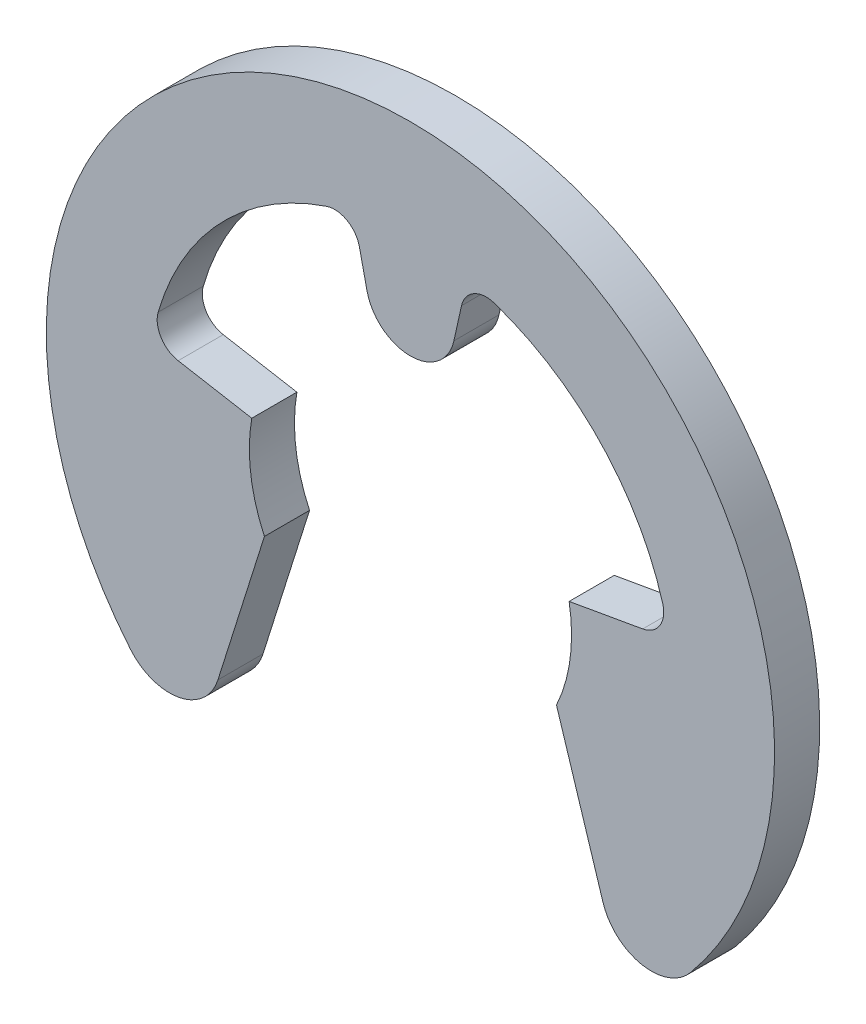
ISO-10303-21;
HEADER;
FILE_DESCRIPTION(('STEP AP214'),'2;1');
FILE_NAME('part.step','',(''),(''),'','','');
FILE_SCHEMA(('AUTOMOTIVE_DESIGN { 1 0 10303 214 1 1 1 1 }'));
ENDSEC;
DATA;
#1=APPLICATION_CONTEXT('core data for automotive mechanical design processes');
#2=APPLICATION_PROTOCOL_DEFINITION('international standard','automotive_design',2000,#1);
#3=PRODUCT_CONTEXT('',#1,'mechanical');
#4=PRODUCT('Part','Part','',(#3));
#5=PRODUCT_RELATED_PRODUCT_CATEGORY('part','',(#4));
#6=PRODUCT_DEFINITION_FORMATION('','',#4);
#7=PRODUCT_DEFINITION_CONTEXT('part definition',#1,'design');
#8=PRODUCT_DEFINITION('design','',#6,#7);
#9=PRODUCT_DEFINITION_SHAPE('','',#8);
#10=(LENGTH_UNIT() NAMED_UNIT(*) SI_UNIT(.MILLI.,.METRE.));
#11=(NAMED_UNIT(*) PLANE_ANGLE_UNIT() SI_UNIT($,.RADIAN.));
#12=(NAMED_UNIT(*) SI_UNIT($,.STERADIAN.) SOLID_ANGLE_UNIT());
#13=UNCERTAINTY_MEASURE_WITH_UNIT(LENGTH_MEASURE(1.E-05),#10,'distance_accuracy_value','');
#14=(GEOMETRIC_REPRESENTATION_CONTEXT(3) GLOBAL_UNCERTAINTY_ASSIGNED_CONTEXT((#13)) GLOBAL_UNIT_ASSIGNED_CONTEXT((#10,
#11,#12)) REPRESENTATION_CONTEXT('',''));
#15=CARTESIAN_POINT('',(0.,0.,0.));
#16=DIRECTION('',(0.,0.,1.));
#17=DIRECTION('',(1.,0.,0.));
#18=AXIS2_PLACEMENT_3D('',#15,#16,#17);
#19=CARTESIAN_POINT('',(0.,0.,-0.7));
#20=DIRECTION('',(0.,0.,1.));
#21=DIRECTION('',(1.,0.,0.));
#22=AXIS2_PLACEMENT_3D('',#19,#20,#21);
#23=CYLINDRICAL_SURFACE('',#22,2.5);
#24=CARTESIAN_POINT('',(0.,0.,0.));
#25=DIRECTION('',(0.,0.,-1.));
#26=DIRECTION('',(1.,0.,0.));
#27=AXIS2_PLACEMENT_3D('',#24,#25,#26);
#28=CIRCLE('',#27,2.5);
#29=CARTESIAN_POINT('',(2.46201938253052,0.434120444167318,0.));
#30=VERTEX_POINT('',#29);
#31=CARTESIAN_POINT('',(2.26576946759162,-1.05654565435176,0.));
#32=VERTEX_POINT('',#31);
#33=EDGE_CURVE('E189',#30,#32,#28,.T.);
#34=ORIENTED_EDGE('',*,*,#33,.F.);
#35=DIRECTION('',(0.,0.,1.));
#36=VECTOR('',#35,1.);
#37=CARTESIAN_POINT('',(2.46201938253052,0.434120444167318,-0.7));
#38=LINE('',#37,#36);
#39=CARTESIAN_POINT('',(2.46201938253052,0.434120444167318,-0.7));
#40=VERTEX_POINT('',#39);
#41=EDGE_CURVE('E11',#40,#30,#38,.T.);
#42=ORIENTED_EDGE('',*,*,#41,.F.);
#43=CARTESIAN_POINT('',(0.,0.,-0.7));
#44=DIRECTION('',(0.,0.,-1.));
#45=DIRECTION('',(1.,0.,0.));
#46=AXIS2_PLACEMENT_3D('',#43,#44,#45);
#47=CIRCLE('',#46,2.5);
#48=CARTESIAN_POINT('',(2.26576946759162,-1.05654565435176,-0.7));
#49=VERTEX_POINT('',#48);
#50=EDGE_CURVE('E239',#40,#49,#47,.T.);
#51=ORIENTED_EDGE('',*,*,#50,.T.);
#52=DIRECTION('',(0.,0.,1.));
#53=VECTOR('',#52,1.);
#54=CARTESIAN_POINT('',(2.26576946759162,-1.05654565435176,-0.7));
#55=LINE('',#54,#53);
#56=EDGE_CURVE('E35',#49,#32,#55,.T.);
#57=ORIENTED_EDGE('',*,*,#56,.T.);
#58=EDGE_LOOP('',(#34,#42,#51,#57));
#59=FACE_BOUND('',#58,.T.);
#60=ADVANCED_FACE('F32',(#59),#23,.F.);
#61=CARTESIAN_POINT('',(2.46201938253052,0.434120444167318,-0.7));
#62=DIRECTION('',(-0.173648177666928,0.984807753012209,0.));
#63=DIRECTION('',(-0.984807753012209,-0.173648177666928,0.));
#64=AXIS2_PLACEMENT_3D('',#61,#62,#63);
#65=PLANE('',#64);
#66=DIRECTION('',(-0.984807753012208,-0.173648177666928,0.));
#67=VECTOR('',#66,1.);
#68=CARTESIAN_POINT('',(2.46201938253052,0.434120444167318,0.));
#69=LINE('',#68,#67);
#70=CARTESIAN_POINT('',(3.60452586515531,0.635575162688392,0.));
#71=VERTEX_POINT('',#70);
#72=EDGE_CURVE('E237',#71,#30,#69,.T.);
#73=ORIENTED_EDGE('',*,*,#72,.F.);
#74=DIRECTION('',(0.,0.,1.));
#75=VECTOR('',#74,1.);
#76=CARTESIAN_POINT('',(3.60452586515531,0.635575162688392,-0.7));
#77=LINE('',#76,#75);
#78=CARTESIAN_POINT('',(3.60452586515531,0.635575162688392,-0.7));
#79=VERTEX_POINT('',#78);
#80=EDGE_CURVE('E41',#79,#71,#77,.T.);
#81=ORIENTED_EDGE('',*,*,#80,.F.);
#82=DIRECTION('',(-0.984807753012208,-0.173648177666928,0.));
#83=VECTOR('',#82,1.);
#84=CARTESIAN_POINT('',(2.46201938253052,0.434120444167318,-0.7));
#85=LINE('',#84,#83);
#86=EDGE_CURVE('E179',#79,#40,#85,.T.);
#87=ORIENTED_EDGE('',*,*,#86,.T.);
#88=ORIENTED_EDGE('',*,*,#41,.T.);
#89=EDGE_LOOP('',(#73,#81,#87,#88));
#90=FACE_BOUND('',#89,.T.);
#91=ADVANCED_FACE('F271',(#90),#65,.T.);
#92=CARTESIAN_POINT('',(3.53615189519896,1.02334321543695,-0.7));
#93=DIRECTION('',(0.,0.,1.));
#94=DIRECTION('',(1.,0.,0.));
#95=AXIS2_PLACEMENT_3D('',#92,#93,#94);
#96=CYLINDRICAL_SURFACE('',#95,0.39375);
#97=CARTESIAN_POINT('',(3.53615189519896,1.02334321543695,0.));
#98=DIRECTION('',(0.,0.,-1.));
#99=DIRECTION('',(1.,0.,0.));
#100=AXIS2_PLACEMENT_3D('',#97,#98,#99);
#101=CIRCLE('',#100,0.39375);
#102=CARTESIAN_POINT('',(3.91438206395538,1.13280097871798,0.));
#103=VERTEX_POINT('',#102);
#104=EDGE_CURVE('E166',#103,#71,#101,.T.);
#105=ORIENTED_EDGE('',*,*,#104,.F.);
#106=DIRECTION('',(0.,0.,1.));
#107=VECTOR('',#106,1.);
#108=CARTESIAN_POINT('',(3.91438206395538,1.13280097871798,-0.7));
#109=LINE('',#108,#107);
#110=CARTESIAN_POINT('',(3.91438206395538,1.13280097871798,-0.7));
#111=VERTEX_POINT('',#110);
#112=EDGE_CURVE('E161',#111,#103,#109,.T.);
#113=ORIENTED_EDGE('',*,*,#112,.F.);
#114=CARTESIAN_POINT('',(3.53615189519896,1.02334321543695,-0.7));
#115=DIRECTION('',(0.,0.,-1.));
#116=DIRECTION('',(1.,0.,0.));
#117=AXIS2_PLACEMENT_3D('',#114,#115,#116);
#118=CIRCLE('',#117,0.39375);
#119=EDGE_CURVE('E164',#111,#79,#118,.T.);
#120=ORIENTED_EDGE('',*,*,#119,.T.);
#121=ORIENTED_EDGE('',*,*,#80,.T.);
#122=EDGE_LOOP('',(#105,#113,#120,#121));
#123=FACE_BOUND('',#122,.T.);
#124=ADVANCED_FACE('F163',(#123),#96,.F.);
#125=CARTESIAN_POINT('',(0.,0.,-0.7));
#126=DIRECTION('',(0.,0.,1.));
#127=DIRECTION('',(1.,0.,0.));
#128=AXIS2_PLACEMENT_3D('',#125,#126,#127);
#129=CYLINDRICAL_SURFACE('',#128,4.075);
#130=CARTESIAN_POINT('',(0.,0.,0.));
#131=DIRECTION('',(0.,0.,-1.));
#132=DIRECTION('',(1.,0.,0.));
#133=AXIS2_PLACEMENT_3D('',#130,#131,#132);
#134=CIRCLE('',#133,4.075);
#135=CARTESIAN_POINT('',(1.30246575073799,3.86124435488801,0.));
#136=VERTEX_POINT('',#135);
#137=EDGE_CURVE('E234',#136,#103,#134,.T.);
#138=ORIENTED_EDGE('',*,*,#137,.F.);
#139=DIRECTION('',(0.,0.,1.));
#140=VECTOR('',#139,1.);
#141=CARTESIAN_POINT('',(1.30246575073799,3.86124435488801,-0.7));
#142=LINE('',#141,#140);
#143=CARTESIAN_POINT('',(1.30246575073799,3.86124435488801,-0.7));
#144=VERTEX_POINT('',#143);
#145=EDGE_CURVE('E171',#144,#136,#142,.T.);
#146=ORIENTED_EDGE('',*,*,#145,.F.);
#147=CARTESIAN_POINT('',(0.,0.,-0.7));
#148=DIRECTION('',(0.,0.,-1.));
#149=DIRECTION('',(1.,0.,0.));
#150=AXIS2_PLACEMENT_3D('',#147,#148,#149);
#151=CIRCLE('',#150,4.075);
#152=EDGE_CURVE('E177',#144,#111,#151,.T.);
#153=ORIENTED_EDGE('',*,*,#152,.T.);
#154=ORIENTED_EDGE('',*,*,#112,.T.);
#155=EDGE_LOOP('',(#138,#146,#153,#154));
#156=FACE_BOUND('',#155,.T.);
#157=ADVANCED_FACE('F181',(#156),#129,.F.);
#158=CARTESIAN_POINT('',(1.17661399874951,3.48814865802,-0.7));
#159=DIRECTION('',(0.,0.,1.));
#160=DIRECTION('',(1.,0.,0.));
#161=AXIS2_PLACEMENT_3D('',#158,#159,#160);
#162=CYLINDRICAL_SURFACE('',#161,0.39375);
#163=CARTESIAN_POINT('',(1.17661399874951,3.48814865802,0.));
#164=DIRECTION('',(0.,0.,-1.));
#165=DIRECTION('',(1.,0.,0.));
#166=AXIS2_PLACEMENT_3D('',#163,#164,#165);
#167=CIRCLE('',#166,0.39375);
#168=CARTESIAN_POINT('',(0.792197445946035,3.57337175600812,0.));
#169=VERTEX_POINT('',#168);
#170=EDGE_CURVE('E231',#169,#136,#167,.T.);
#171=ORIENTED_EDGE('',*,*,#170,.F.);
#172=DIRECTION('',(0.,0.,1.));
#173=VECTOR('',#172,1.);
#174=CARTESIAN_POINT('',(0.792197445946035,3.57337175600812,-0.7));
#175=LINE('',#174,#173);
#176=CARTESIAN_POINT('',(0.792197445946035,3.57337175600812,-0.7));
#177=VERTEX_POINT('',#176);
#178=EDGE_CURVE('E243',#177,#169,#175,.T.);
#179=ORIENTED_EDGE('',*,*,#178,.F.);
#180=CARTESIAN_POINT('',(1.17661399874951,3.48814865802,-0.7));
#181=DIRECTION('',(0.,0.,-1.));
#182=DIRECTION('',(1.,0.,0.));
#183=AXIS2_PLACEMENT_3D('',#180,#181,#182);
#184=CIRCLE('',#183,0.39375);
#185=EDGE_CURVE('E182',#177,#144,#184,.T.);
#186=ORIENTED_EDGE('',*,*,#185,.T.);
#187=ORIENTED_EDGE('',*,*,#145,.T.);
#188=EDGE_LOOP('',(#171,#179,#186,#187));
#189=FACE_BOUND('',#188,.T.);
#190=ADVANCED_FACE('F284',(#189),#162,.F.);
#191=CARTESIAN_POINT('',(0.674195424593791,3.04109903484525,-0.7));
#192=DIRECTION('',(0.976296007119933,-0.216439613938103,0.));
#193=DIRECTION('',(0.216439613938103,0.976296007119933,0.));
#194=AXIS2_PLACEMENT_3D('',#191,#192,#193);
#195=PLANE('',#194);
#196=DIRECTION('',(0.216439613938103,0.976296007119933,0.));
#197=VECTOR('',#196,1.);
#198=CARTESIAN_POINT('',(0.674195424593791,3.04109903484525,0.));
#199=LINE('',#198,#197);
#200=CARTESIAN_POINT('',(0.674195424593791,3.04109903484525,0.));
#201=VERTEX_POINT('',#200);
#202=EDGE_CURVE('E228',#201,#169,#199,.T.);
#203=ORIENTED_EDGE('',*,*,#202,.F.);
#204=DIRECTION('',(0.,0.,1.));
#205=VECTOR('',#204,1.);
#206=CARTESIAN_POINT('',(0.674195424593791,3.04109903484525,-0.7));
#207=LINE('',#206,#205);
#208=CARTESIAN_POINT('',(0.674195424593791,3.04109903484525,-0.7));
#209=VERTEX_POINT('',#208);
#210=EDGE_CURVE('E245',#209,#201,#207,.T.);
#211=ORIENTED_EDGE('',*,*,#210,.F.);
#212=DIRECTION('',(0.216439613938103,0.976296007119933,0.));
#213=VECTOR('',#212,1.);
#214=CARTESIAN_POINT('',(0.674195424593791,3.04109903484525,-0.7));
#215=LINE('',#214,#213);
#216=EDGE_CURVE('E184',#209,#177,#215,.T.);
#217=ORIENTED_EDGE('',*,*,#216,.T.);
#218=ORIENTED_EDGE('',*,*,#178,.T.);
#219=EDGE_LOOP('',(#203,#211,#217,#218));
#220=FACE_BOUND('',#219,.T.);
#221=ADVANCED_FACE('F287',(#220),#195,.T.);
#222=CARTESIAN_POINT('',(0.,3.19056456205598,-0.7));
#223=DIRECTION('',(0.,0.,1.));
#224=DIRECTION('',(1.,0.,0.));
#225=AXIS2_PLACEMENT_3D('',#222,#223,#224);
#226=CYLINDRICAL_SURFACE('',#225,0.690564562055992);
#227=CARTESIAN_POINT('',(0.,3.19056456205598,0.));
#228=DIRECTION('',(0.,0.,1.));
#229=DIRECTION('',(1.,0.,0.));
#230=AXIS2_PLACEMENT_3D('',#227,#228,#229);
#231=CIRCLE('',#230,0.690564562055992);
#232=CARTESIAN_POINT('',(-0.674195424593791,3.04109903484525,0.));
#233=VERTEX_POINT('',#232);
#234=EDGE_CURVE('E225',#233,#201,#231,.T.);
#235=ORIENTED_EDGE('',*,*,#234,.F.);
#236=DIRECTION('',(0.,0.,1.));
#237=VECTOR('',#236,1.);
#238=CARTESIAN_POINT('',(-0.674195424593791,3.04109903484525,-0.7));
#239=LINE('',#238,#237);
#240=CARTESIAN_POINT('',(-0.674195424593791,3.04109903484525,-0.7));
#241=VERTEX_POINT('',#240);
#242=EDGE_CURVE('E247',#241,#233,#239,.T.);
#243=ORIENTED_EDGE('',*,*,#242,.F.);
#244=CARTESIAN_POINT('',(0.,3.19056456205598,-0.7));
#245=DIRECTION('',(0.,0.,1.));
#246=DIRECTION('',(1.,0.,0.));
#247=AXIS2_PLACEMENT_3D('',#244,#245,#246);
#248=CIRCLE('',#247,0.690564562055992);
#249=EDGE_CURVE('E495',#241,#209,#248,.T.);
#250=ORIENTED_EDGE('',*,*,#249,.T.);
#251=ORIENTED_EDGE('',*,*,#210,.T.);
#252=EDGE_LOOP('',(#235,#243,#250,#251));
#253=FACE_BOUND('',#252,.T.);
#254=ADVANCED_FACE('F291',(#253),#226,.T.);
#255=CARTESIAN_POINT('',(-0.674195424593791,3.04109903484525,-0.7));
#256=DIRECTION('',(-0.976296007119933,-0.216439613938103,0.));
#257=DIRECTION('',(0.216439613938103,-0.976296007119933,0.));
#258=AXIS2_PLACEMENT_3D('',#255,#256,#257);
#259=PLANE('',#258);
#260=DIRECTION('',(0.216439613938103,-0.976296007119933,0.));
#261=VECTOR('',#260,1.);
#262=CARTESIAN_POINT('',(-0.674195424593791,3.04109903484525,0.));
#263=LINE('',#262,#261);
#264=CARTESIAN_POINT('',(-0.792197445946034,3.57337175600812,0.));
#265=VERTEX_POINT('',#264);
#266=EDGE_CURVE('E222',#265,#233,#263,.T.);
#267=ORIENTED_EDGE('',*,*,#266,.F.);
#268=DIRECTION('',(0.,0.,1.));
#269=VECTOR('',#268,1.);
#270=CARTESIAN_POINT('',(-0.792197445946034,3.57337175600812,-0.7));
#271=LINE('',#270,#269);
#272=CARTESIAN_POINT('',(-0.792197445946034,3.57337175600812,-0.7));
#273=VERTEX_POINT('',#272);
#274=EDGE_CURVE('E249',#273,#265,#271,.T.);
#275=ORIENTED_EDGE('',*,*,#274,.F.);
#276=DIRECTION('',(0.216439613938103,-0.976296007119933,0.));
#277=VECTOR('',#276,1.);
#278=CARTESIAN_POINT('',(-0.674195424593791,3.04109903484525,-0.7));
#279=LINE('',#278,#277);
#280=EDGE_CURVE('E499',#273,#241,#279,.T.);
#281=ORIENTED_EDGE('',*,*,#280,.T.);
#282=ORIENTED_EDGE('',*,*,#242,.T.);
#283=EDGE_LOOP('',(#267,#275,#281,#282));
#284=FACE_BOUND('',#283,.T.);
#285=ADVANCED_FACE('F295',(#284),#259,.T.);
#286=CARTESIAN_POINT('',(-1.17661399874951,3.48814865802,-0.7));
#287=DIRECTION('',(0.,0.,1.));
#288=DIRECTION('',(1.,0.,0.));
#289=AXIS2_PLACEMENT_3D('',#286,#287,#288);
#290=CYLINDRICAL_SURFACE('',#289,0.39375);
#291=CARTESIAN_POINT('',(-1.17661399874951,3.48814865802,0.));
#292=DIRECTION('',(0.,0.,-1.));
#293=DIRECTION('',(1.,0.,0.));
#294=AXIS2_PLACEMENT_3D('',#291,#292,#293);
#295=CIRCLE('',#294,0.39375);
#296=CARTESIAN_POINT('',(-1.302465750738,3.86124435488801,0.));
#297=VERTEX_POINT('',#296);
#298=EDGE_CURVE('E219',#297,#265,#295,.T.);
#299=ORIENTED_EDGE('',*,*,#298,.F.);
#300=DIRECTION('',(0.,0.,1.));
#301=VECTOR('',#300,1.);
#302=CARTESIAN_POINT('',(-1.302465750738,3.86124435488801,-0.7));
#303=LINE('',#302,#301);
#304=CARTESIAN_POINT('',(-1.302465750738,3.86124435488801,-0.7));
#305=VERTEX_POINT('',#304);
#306=EDGE_CURVE('E251',#305,#297,#303,.T.);
#307=ORIENTED_EDGE('',*,*,#306,.F.);
#308=CARTESIAN_POINT('',(-1.17661399874951,3.48814865802,-0.7));
#309=DIRECTION('',(0.,0.,-1.));
#310=DIRECTION('',(1.,0.,0.));
#311=AXIS2_PLACEMENT_3D('',#308,#309,#310);
#312=CIRCLE('',#311,0.39375);
#313=EDGE_CURVE('E488',#305,#273,#312,.T.);
#314=ORIENTED_EDGE('',*,*,#313,.T.);
#315=ORIENTED_EDGE('',*,*,#274,.T.);
#316=EDGE_LOOP('',(#299,#307,#314,#315));
#317=FACE_BOUND('',#316,.T.);
#318=ADVANCED_FACE('F299',(#317),#290,.F.);
#319=CARTESIAN_POINT('',(0.,0.,-0.7));
#320=DIRECTION('',(0.,0.,1.));
#321=DIRECTION('',(1.,0.,0.));
#322=AXIS2_PLACEMENT_3D('',#319,#320,#321);
#323=CYLINDRICAL_SURFACE('',#322,4.075);
#324=CARTESIAN_POINT('',(0.,0.,0.));
#325=DIRECTION('',(0.,0.,-1.));
#326=DIRECTION('',(1.,0.,0.));
#327=AXIS2_PLACEMENT_3D('',#324,#325,#326);
#328=CIRCLE('',#327,4.075);
#329=CARTESIAN_POINT('',(-3.91438206395538,1.13280097871798,0.));
#330=VERTEX_POINT('',#329);
#331=EDGE_CURVE('E216',#330,#297,#328,.T.);
#332=ORIENTED_EDGE('',*,*,#331,.F.);
#333=DIRECTION('',(0.,0.,1.));
#334=VECTOR('',#333,1.);
#335=CARTESIAN_POINT('',(-3.91438206395538,1.13280097871798,-0.7));
#336=LINE('',#335,#334);
#337=CARTESIAN_POINT('',(-3.91438206395538,1.13280097871798,-0.7));
#338=VERTEX_POINT('',#337);
#339=EDGE_CURVE('E253',#338,#330,#336,.T.);
#340=ORIENTED_EDGE('',*,*,#339,.F.);
#341=CARTESIAN_POINT('',(0.,0.,-0.7));
#342=DIRECTION('',(0.,0.,-1.));
#343=DIRECTION('',(1.,0.,0.));
#344=AXIS2_PLACEMENT_3D('',#341,#342,#343);
#345=CIRCLE('',#344,4.075);
#346=EDGE_CURVE('E484',#338,#305,#345,.T.);
#347=ORIENTED_EDGE('',*,*,#346,.T.);
#348=ORIENTED_EDGE('',*,*,#306,.T.);
#349=EDGE_LOOP('',(#332,#340,#347,#348));
#350=FACE_BOUND('',#349,.T.);
#351=ADVANCED_FACE('F303',(#350),#323,.F.);
#352=CARTESIAN_POINT('',(-3.53615189519896,1.02334321543695,-0.7));
#353=DIRECTION('',(0.,0.,1.));
#354=DIRECTION('',(1.,0.,0.));
#355=AXIS2_PLACEMENT_3D('',#352,#353,#354);
#356=CYLINDRICAL_SURFACE('',#355,0.39375);
#357=CARTESIAN_POINT('',(-3.53615189519896,1.02334321543695,0.));
#358=DIRECTION('',(0.,0.,-1.));
#359=DIRECTION('',(1.,0.,0.));
#360=AXIS2_PLACEMENT_3D('',#357,#358,#359);
#361=CIRCLE('',#360,0.39375);
#362=CARTESIAN_POINT('',(-3.60452586515531,0.635575162688392,0.));
#363=VERTEX_POINT('',#362);
#364=EDGE_CURVE('E213',#363,#330,#361,.T.);
#365=ORIENTED_EDGE('',*,*,#364,.F.);
#366=DIRECTION('',(0.,0.,1.));
#367=VECTOR('',#366,1.);
#368=CARTESIAN_POINT('',(-3.60452586515531,0.635575162688392,-0.7));
#369=LINE('',#368,#367);
#370=CARTESIAN_POINT('',(-3.60452586515531,0.635575162688392,-0.7));
#371=VERTEX_POINT('',#370);
#372=EDGE_CURVE('E255',#371,#363,#369,.T.);
#373=ORIENTED_EDGE('',*,*,#372,.F.);
#374=CARTESIAN_POINT('',(-3.53615189519896,1.02334321543695,-0.7));
#375=DIRECTION('',(0.,0.,-1.));
#376=DIRECTION('',(1.,0.,0.));
#377=AXIS2_PLACEMENT_3D('',#374,#375,#376);
#378=CIRCLE('',#377,0.39375);
#379=EDGE_CURVE('E505',#371,#338,#378,.T.);
#380=ORIENTED_EDGE('',*,*,#379,.T.);
#381=ORIENTED_EDGE('',*,*,#339,.T.);
#382=EDGE_LOOP('',(#365,#373,#380,#381));
#383=FACE_BOUND('',#382,.T.);
#384=ADVANCED_FACE('F307',(#383),#356,.F.);
#385=CARTESIAN_POINT('',(-2.46201938253052,0.434120444167318,-0.7));
#386=DIRECTION('',(0.173648177666928,0.984807753012209,0.));
#387=DIRECTION('',(-0.984807753012209,0.173648177666928,0.));
#388=AXIS2_PLACEMENT_3D('',#385,#386,#387);
#389=PLANE('',#388);
#390=DIRECTION('',(-0.984807753012208,0.173648177666928,0.));
#391=VECTOR('',#390,1.);
#392=CARTESIAN_POINT('',(-2.46201938253052,0.434120444167318,0.));
#393=LINE('',#392,#391);
#394=CARTESIAN_POINT('',(-2.46201938253052,0.434120444167318,0.));
#395=VERTEX_POINT('',#394);
#396=EDGE_CURVE('E210',#395,#363,#393,.T.);
#397=ORIENTED_EDGE('',*,*,#396,.F.);
#398=DIRECTION('',(0.,0.,1.));
#399=VECTOR('',#398,1.);
#400=CARTESIAN_POINT('',(-2.46201938253052,0.434120444167318,-0.7));
#401=LINE('',#400,#399);
#402=CARTESIAN_POINT('',(-2.46201938253052,0.434120444167318,-0.7));
#403=VERTEX_POINT('',#402);
#404=EDGE_CURVE('E257',#403,#395,#401,.T.);
#405=ORIENTED_EDGE('',*,*,#404,.F.);
#406=DIRECTION('',(-0.984807753012208,0.173648177666928,0.));
#407=VECTOR('',#406,1.);
#408=CARTESIAN_POINT('',(-2.46201938253052,0.434120444167318,-0.7));
#409=LINE('',#408,#407);
#410=EDGE_CURVE('E477',#403,#371,#409,.T.);
#411=ORIENTED_EDGE('',*,*,#410,.T.);
#412=ORIENTED_EDGE('',*,*,#372,.T.);
#413=EDGE_LOOP('',(#397,#405,#411,#412));
#414=FACE_BOUND('',#413,.T.);
#415=ADVANCED_FACE('F311',(#414),#389,.T.);
#416=CARTESIAN_POINT('',(0.,0.,-0.7));
#417=DIRECTION('',(0.,0.,1.));
#418=DIRECTION('',(1.,0.,0.));
#419=AXIS2_PLACEMENT_3D('',#416,#417,#418);
#420=CYLINDRICAL_SURFACE('',#419,2.5);
#421=CARTESIAN_POINT('',(0.,0.,0.));
#422=DIRECTION('',(0.,0.,-1.));
#423=DIRECTION('',(1.,0.,0.));
#424=AXIS2_PLACEMENT_3D('',#421,#422,#423);
#425=CIRCLE('',#424,2.5);
#426=CARTESIAN_POINT('',(-2.26576946759162,-1.05654565435176,0.));
#427=VERTEX_POINT('',#426);
#428=EDGE_CURVE('E207',#427,#395,#425,.T.);
#429=ORIENTED_EDGE('',*,*,#428,.F.);
#430=DIRECTION('',(0.,0.,1.));
#431=VECTOR('',#430,1.);
#432=CARTESIAN_POINT('',(-2.26576946759162,-1.05654565435176,-0.7));
#433=LINE('',#432,#431);
#434=CARTESIAN_POINT('',(-2.26576946759162,-1.05654565435176,-0.7));
#435=VERTEX_POINT('',#434);
#436=EDGE_CURVE('E259',#435,#427,#433,.T.);
#437=ORIENTED_EDGE('',*,*,#436,.F.);
#438=CARTESIAN_POINT('',(0.,0.,-0.7));
#439=DIRECTION('',(0.,0.,-1.));
#440=DIRECTION('',(1.,0.,0.));
#441=AXIS2_PLACEMENT_3D('',#438,#439,#440);
#442=CIRCLE('',#441,2.5);
#443=EDGE_CURVE('E473',#435,#403,#442,.T.);
#444=ORIENTED_EDGE('',*,*,#443,.T.);
#445=ORIENTED_EDGE('',*,*,#404,.T.);
#446=EDGE_LOOP('',(#429,#437,#444,#445));
#447=FACE_BOUND('',#446,.T.);
#448=ADVANCED_FACE('F315',(#447),#420,.F.);
#449=CARTESIAN_POINT('',(-2.26576946759162,-1.05654565435176,-0.7));
#450=DIRECTION('',(0.953716950748227,-0.300705799504273,0.));
#451=DIRECTION('',(0.300705799504273,0.953716950748227,0.));
#452=AXIS2_PLACEMENT_3D('',#449,#450,#451);
#453=PLANE('',#452);
#454=DIRECTION('',(0.300705799504273,0.953716950748227,0.));
#455=VECTOR('',#454,1.);
#456=CARTESIAN_POINT('',(-2.26576946759162,-1.05654565435176,0.));
#457=LINE('',#456,#455);
#458=CARTESIAN_POINT('',(-2.98759714932915,-3.34589057795238,0.));
#459=VERTEX_POINT('',#458);
#460=EDGE_CURVE('E204',#459,#427,#457,.T.);
#461=ORIENTED_EDGE('',*,*,#460,.F.);
#462=DIRECTION('',(0.,0.,1.));
#463=VECTOR('',#462,1.);
#464=CARTESIAN_POINT('',(-2.98759714932915,-3.34589057795238,-0.7));
#465=LINE('',#464,#463);
#466=CARTESIAN_POINT('',(-2.98759714932915,-3.34589057795238,-0.7));
#467=VERTEX_POINT('',#466);
#468=EDGE_CURVE('E261',#467,#459,#465,.T.);
#469=ORIENTED_EDGE('',*,*,#468,.F.);
#470=DIRECTION('',(0.300705799504273,0.953716950748227,0.));
#471=VECTOR('',#470,1.);
#472=CARTESIAN_POINT('',(-2.26576946759162,-1.05654565435176,-0.7));
#473=LINE('',#472,#471);
#474=EDGE_CURVE('E509',#467,#435,#473,.T.);
#475=ORIENTED_EDGE('',*,*,#474,.T.);
#476=ORIENTED_EDGE('',*,*,#436,.T.);
#477=EDGE_LOOP('',(#461,#469,#475,#476));
#478=FACE_BOUND('',#477,.T.);
#479=ADVANCED_FACE('F319',(#478),#453,.T.);
#480=CARTESIAN_POINT('',(-3.73864924804338,-3.10908476084276,-0.7));
#481=DIRECTION('',(0.,0.,1.));
#482=DIRECTION('',(1.,0.,0.));
#483=AXIS2_PLACEMENT_3D('',#480,#481,#482);
#484=CYLINDRICAL_SURFACE('',#483,0.7875);
#485=CARTESIAN_POINT('',(-3.73864924804338,-3.10908476084276,0.));
#486=DIRECTION('',(0.,0.,1.));
#487=DIRECTION('',(1.,0.,0.));
#488=AXIS2_PLACEMENT_3D('',#485,#486,#487);
#489=CIRCLE('',#488,0.7875);
#490=CARTESIAN_POINT('',(-4.3441374296031,-3.61261262699468,0.));
#491=VERTEX_POINT('',#490);
#492=EDGE_CURVE('E201',#491,#459,#489,.T.);
#493=ORIENTED_EDGE('',*,*,#492,.F.);
#494=DIRECTION('',(0.,0.,1.));
#495=VECTOR('',#494,1.);
#496=CARTESIAN_POINT('',(-4.3441374296031,-3.61261262699468,-0.7));
#497=LINE('',#496,#495);
#498=CARTESIAN_POINT('',(-4.3441374296031,-3.61261262699468,-0.7));
#499=VERTEX_POINT('',#498);
#500=EDGE_CURVE('E263',#499,#491,#497,.T.);
#501=ORIENTED_EDGE('',*,*,#500,.F.);
#502=CARTESIAN_POINT('',(-3.73864924804338,-3.10908476084276,-0.7));
#503=DIRECTION('',(0.,0.,1.));
#504=DIRECTION('',(1.,0.,0.));
#505=AXIS2_PLACEMENT_3D('',#502,#503,#504);
#506=CIRCLE('',#505,0.7875);
#507=EDGE_CURVE('E466',#499,#467,#506,.T.);
#508=ORIENTED_EDGE('',*,*,#507,.T.);
#509=ORIENTED_EDGE('',*,*,#468,.T.);
#510=EDGE_LOOP('',(#493,#501,#508,#509));
#511=FACE_BOUND('',#510,.T.);
#512=ADVANCED_FACE('F323',(#511),#484,.T.);
#513=CARTESIAN_POINT('',(0.,0.,-0.7));
#514=DIRECTION('',(0.,0.,1.));
#515=DIRECTION('',(1.,0.,0.));
#516=AXIS2_PLACEMENT_3D('',#513,#514,#515);
#517=CYLINDRICAL_SURFACE('',#516,5.65);
#518=CARTESIAN_POINT('',(0.,0.,0.));
#519=DIRECTION('',(0.,0.,1.));
#520=DIRECTION('',(1.,0.,0.));
#521=AXIS2_PLACEMENT_3D('',#518,#519,#520);
#522=CIRCLE('',#521,5.65);
#523=CARTESIAN_POINT('',(4.3441374296031,-3.61261262699468,0.));
#524=VERTEX_POINT('',#523);
#525=EDGE_CURVE('E198',#524,#491,#522,.T.);
#526=ORIENTED_EDGE('',*,*,#525,.F.);
#527=DIRECTION('',(0.,0.,1.));
#528=VECTOR('',#527,1.);
#529=CARTESIAN_POINT('',(4.3441374296031,-3.61261262699468,-0.7));
#530=LINE('',#529,#528);
#531=CARTESIAN_POINT('',(4.3441374296031,-3.61261262699468,-0.7));
#532=VERTEX_POINT('',#531);
#533=EDGE_CURVE('E265',#532,#524,#530,.T.);
#534=ORIENTED_EDGE('',*,*,#533,.F.);
#535=CARTESIAN_POINT('',(0.,0.,-0.7));
#536=DIRECTION('',(0.,0.,1.));
#537=DIRECTION('',(1.,0.,0.));
#538=AXIS2_PLACEMENT_3D('',#535,#536,#537);
#539=CIRCLE('',#538,5.65);
#540=EDGE_CURVE('E462',#532,#499,#539,.T.);
#541=ORIENTED_EDGE('',*,*,#540,.T.);
#542=ORIENTED_EDGE('',*,*,#500,.T.);
#543=EDGE_LOOP('',(#526,#534,#541,#542));
#544=FACE_BOUND('',#543,.T.);
#545=ADVANCED_FACE('F327',(#544),#517,.T.);
#546=CARTESIAN_POINT('',(3.73864924804338,-3.10908476084276,-0.7));
#547=DIRECTION('',(0.,0.,1.));
#548=DIRECTION('',(1.,0.,0.));
#549=AXIS2_PLACEMENT_3D('',#546,#547,#548);
#550=CYLINDRICAL_SURFACE('',#549,0.7875);
#551=CARTESIAN_POINT('',(3.73864924804338,-3.10908476084276,0.));
#552=DIRECTION('',(0.,0.,1.));
#553=DIRECTION('',(1.,0.,0.));
#554=AXIS2_PLACEMENT_3D('',#551,#552,#553);
#555=CIRCLE('',#554,0.7875);
#556=CARTESIAN_POINT('',(2.98759714932915,-3.34589057795238,0.));
#557=VERTEX_POINT('',#556);
#558=EDGE_CURVE('E195',#557,#524,#555,.T.);
#559=ORIENTED_EDGE('',*,*,#558,.F.);
#560=DIRECTION('',(0.,0.,1.));
#561=VECTOR('',#560,1.);
#562=CARTESIAN_POINT('',(2.98759714932915,-3.34589057795238,-0.7));
#563=LINE('',#562,#561);
#564=CARTESIAN_POINT('',(2.98759714932915,-3.34589057795238,-0.7));
#565=VERTEX_POINT('',#564);
#566=EDGE_CURVE('E266',#565,#557,#563,.T.);
#567=ORIENTED_EDGE('',*,*,#566,.F.);
#568=CARTESIAN_POINT('',(3.73864924804338,-3.10908476084276,-0.7));
#569=DIRECTION('',(0.,0.,1.));
#570=DIRECTION('',(1.,0.,0.));
#571=AXIS2_PLACEMENT_3D('',#568,#569,#570);
#572=CIRCLE('',#571,0.7875);
#573=EDGE_CURVE('E513',#565,#532,#572,.T.);
#574=ORIENTED_EDGE('',*,*,#573,.T.);
#575=ORIENTED_EDGE('',*,*,#533,.T.);
#576=EDGE_LOOP('',(#559,#567,#574,#575));
#577=FACE_BOUND('',#576,.T.);
#578=ADVANCED_FACE('F331',(#577),#550,.T.);
#579=CARTESIAN_POINT('',(2.26576946759162,-1.05654565435176,-0.7));
#580=DIRECTION('',(-0.953716950748227,-0.300705799504273,0.));
#581=DIRECTION('',(0.300705799504273,-0.953716950748227,0.));
#582=AXIS2_PLACEMENT_3D('',#579,#580,#581);
#583=PLANE('',#582);
#584=DIRECTION('',(0.300705799504273,-0.953716950748227,0.));
#585=VECTOR('',#584,1.);
#586=CARTESIAN_POINT('',(2.26576946759162,-1.05654565435176,0.));
#587=LINE('',#586,#585);
#588=EDGE_CURVE('E192',#32,#557,#587,.T.);
#589=ORIENTED_EDGE('',*,*,#588,.F.);
#590=ORIENTED_EDGE('',*,*,#56,.F.);
#591=DIRECTION('',(0.300705799504273,-0.953716950748227,0.));
#592=VECTOR('',#591,1.);
#593=CARTESIAN_POINT('',(2.26576946759162,-1.05654565435176,-0.7));
#594=LINE('',#593,#592);
#595=EDGE_CURVE('E515',#49,#565,#594,.T.);
#596=ORIENTED_EDGE('',*,*,#595,.T.);
#597=ORIENTED_EDGE('',*,*,#566,.T.);
#598=EDGE_LOOP('',(#589,#590,#596,#597));
#599=FACE_BOUND('',#598,.T.);
#600=ADVANCED_FACE('F268',(#599),#583,.T.);
#601=CARTESIAN_POINT('',(0.,0.,-0.7));
#602=DIRECTION('',(0.,0.,1.));
#603=DIRECTION('',(1.,0.,0.));
#604=AXIS2_PLACEMENT_3D('',#601,#602,#603);
#605=PLANE('',#604);
#606=ORIENTED_EDGE('',*,*,#50,.F.);
#607=ORIENTED_EDGE('',*,*,#86,.F.);
#608=ORIENTED_EDGE('',*,*,#119,.F.);
#609=ORIENTED_EDGE('',*,*,#152,.F.);
#610=ORIENTED_EDGE('',*,*,#185,.F.);
#611=ORIENTED_EDGE('',*,*,#216,.F.);
#612=ORIENTED_EDGE('',*,*,#249,.F.);
#613=ORIENTED_EDGE('',*,*,#280,.F.);
#614=ORIENTED_EDGE('',*,*,#313,.F.);
#615=ORIENTED_EDGE('',*,*,#346,.F.);
#616=ORIENTED_EDGE('',*,*,#379,.F.);
#617=ORIENTED_EDGE('',*,*,#410,.F.);
#618=ORIENTED_EDGE('',*,*,#443,.F.);
#619=ORIENTED_EDGE('',*,*,#474,.F.);
#620=ORIENTED_EDGE('',*,*,#507,.F.);
#621=ORIENTED_EDGE('',*,*,#540,.F.);
#622=ORIENTED_EDGE('',*,*,#573,.F.);
#623=ORIENTED_EDGE('',*,*,#595,.F.);
#624=EDGE_LOOP('',(#606,#607,#608,#609,#610,#611,#612,#613,#614,#615,#616,#617,#618,#619,#620,
#621,#622,#623));
#625=FACE_BOUND('',#624,.T.);
#626=ADVANCED_FACE('F175',(#625),#605,.F.);
#627=CARTESIAN_POINT('',(0.,0.,0.));
#628=DIRECTION('',(0.,0.,1.));
#629=DIRECTION('',(1.,0.,0.));
#630=AXIS2_PLACEMENT_3D('',#627,#628,#629);
#631=PLANE('',#630);
#632=ORIENTED_EDGE('',*,*,#33,.T.);
#633=ORIENTED_EDGE('',*,*,#588,.T.);
#634=ORIENTED_EDGE('',*,*,#558,.T.);
#635=ORIENTED_EDGE('',*,*,#525,.T.);
#636=ORIENTED_EDGE('',*,*,#492,.T.);
#637=ORIENTED_EDGE('',*,*,#460,.T.);
#638=ORIENTED_EDGE('',*,*,#428,.T.);
#639=ORIENTED_EDGE('',*,*,#396,.T.);
#640=ORIENTED_EDGE('',*,*,#364,.T.);
#641=ORIENTED_EDGE('',*,*,#331,.T.);
#642=ORIENTED_EDGE('',*,*,#298,.T.);
#643=ORIENTED_EDGE('',*,*,#266,.T.);
#644=ORIENTED_EDGE('',*,*,#234,.T.);
#645=ORIENTED_EDGE('',*,*,#202,.T.);
#646=ORIENTED_EDGE('',*,*,#170,.T.);
#647=ORIENTED_EDGE('',*,*,#137,.T.);
#648=ORIENTED_EDGE('',*,*,#104,.T.);
#649=ORIENTED_EDGE('',*,*,#72,.T.);
#650=EDGE_LOOP('',(#632,#633,#634,#635,#636,#637,#638,#639,#640,#641,#642,#643,#644,#645,#646,
#647,#648,#649));
#651=FACE_BOUND('',#650,.T.);
#652=ADVANCED_FACE('F270',(#651),#631,.T.);
#653=CLOSED_SHELL('',(#60,#91,#124,#157,#190,#221,#254,#285,#318,#351,#384,#415,#448,#479,#512,
#545,#578,#600,#626,#652));
#654=MANIFOLD_SOLID_BREP('B2',#653);
#655=ADVANCED_BREP_SHAPE_REPRESENTATION('',(#18,#654),#14);
#656=SHAPE_DEFINITION_REPRESENTATION(#9,#655);
ENDSEC;
END-ISO-10303-21;
